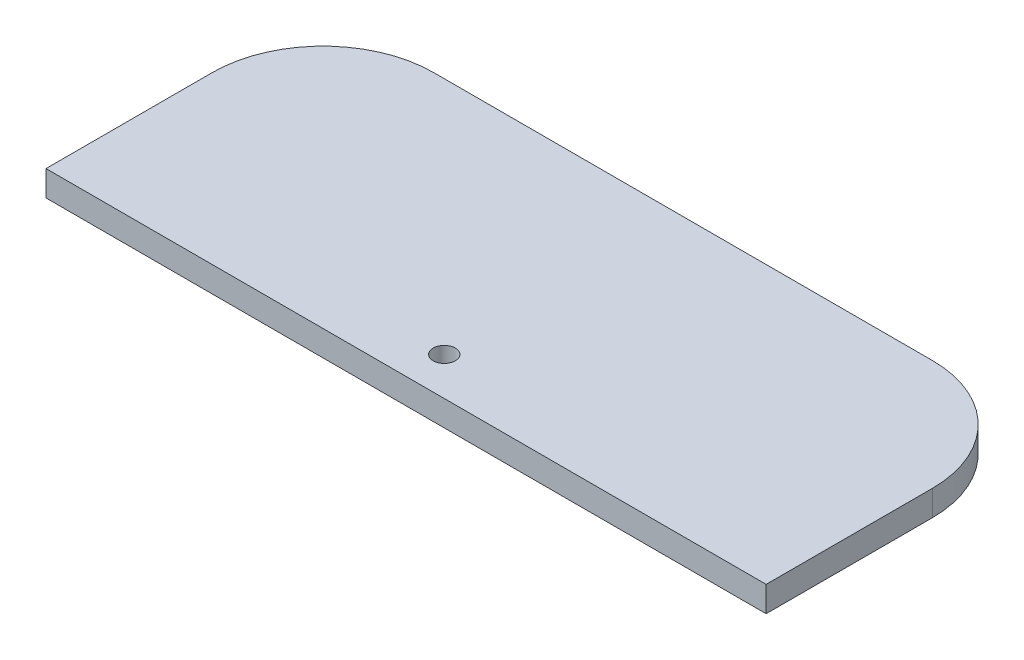
ISO-10303-21;
HEADER;
FILE_DESCRIPTION(('STEP AP214'),'2;1');
FILE_NAME('part.step','',(''),(''),'','','');
FILE_SCHEMA(('AUTOMOTIVE_DESIGN { 1 0 10303 214 1 1 1 1 }'));
ENDSEC;
DATA;
#1=APPLICATION_CONTEXT('core data for automotive mechanical design processes');
#2=APPLICATION_PROTOCOL_DEFINITION('international standard','automotive_design',2000,#1);
#3=PRODUCT_CONTEXT('',#1,'mechanical');
#4=PRODUCT('Part','Part','',(#3));
#5=PRODUCT_RELATED_PRODUCT_CATEGORY('part','',(#4));
#6=PRODUCT_DEFINITION_FORMATION('','',#4);
#7=PRODUCT_DEFINITION_CONTEXT('part definition',#1,'design');
#8=PRODUCT_DEFINITION('design','',#6,#7);
#9=PRODUCT_DEFINITION_SHAPE('','',#8);
#10=(LENGTH_UNIT() NAMED_UNIT(*) SI_UNIT(.MILLI.,.METRE.));
#11=(NAMED_UNIT(*) PLANE_ANGLE_UNIT() SI_UNIT($,.RADIAN.));
#12=(NAMED_UNIT(*) SI_UNIT($,.STERADIAN.) SOLID_ANGLE_UNIT());
#13=UNCERTAINTY_MEASURE_WITH_UNIT(LENGTH_MEASURE(1.E-05),#10,'distance_accuracy_value','');
#14=(GEOMETRIC_REPRESENTATION_CONTEXT(3) GLOBAL_UNCERTAINTY_ASSIGNED_CONTEXT((#13)) GLOBAL_UNIT_ASSIGNED_CONTEXT((#10,
#11,#12)) REPRESENTATION_CONTEXT('',''));
#15=CARTESIAN_POINT('',(0.,0.,0.));
#16=DIRECTION('',(0.,0.,1.));
#17=DIRECTION('',(1.,0.,0.));
#18=AXIS2_PLACEMENT_3D('',#15,#16,#17);
#19=CARTESIAN_POINT('',(0.,2.3,0.));
#20=DIRECTION('',(0.,1.,0.));
#21=DIRECTION('',(0.,0.,1.));
#22=AXIS2_PLACEMENT_3D('',#19,#20,#21);
#23=PLANE('',#22);
#24=DIRECTION('',(0.,0.,-1.));
#25=VECTOR('',#24,1.);
#26=CARTESIAN_POINT('',(32.5,2.3,-12.5));
#27=LINE('',#26,#25);
#28=CARTESIAN_POINT('',(32.5,2.3,12.5));
#29=VERTEX_POINT('',#28);
#30=CARTESIAN_POINT('',(32.5,2.3,-2.5));
#31=VERTEX_POINT('',#30);
#32=EDGE_CURVE('E126',#29,#31,#27,.T.);
#33=ORIENTED_EDGE('',*,*,#32,.T.);
#34=CARTESIAN_POINT('',(22.5,2.3,-2.5));
#35=DIRECTION('',(0.,1.,0.));
#36=DIRECTION('',(0.,0.,1.));
#37=AXIS2_PLACEMENT_3D('',#34,#35,#36);
#38=CIRCLE('',#37,10.);
#39=CARTESIAN_POINT('',(22.5,2.3,-12.5));
#40=VERTEX_POINT('',#39);
#41=EDGE_CURVE('E47',#31,#40,#38,.T.);
#42=ORIENTED_EDGE('',*,*,#41,.T.);
#43=DIRECTION('',(-1.,0.,0.));
#44=VECTOR('',#43,1.);
#45=CARTESIAN_POINT('',(-32.5,2.3,-12.5));
#46=LINE('',#45,#44);
#47=CARTESIAN_POINT('',(-22.5,2.3,-12.5));
#48=VERTEX_POINT('',#47);
#49=EDGE_CURVE('E100',#40,#48,#46,.T.);
#50=ORIENTED_EDGE('',*,*,#49,.T.);
#51=CARTESIAN_POINT('',(-22.5,2.3,-2.5));
#52=DIRECTION('',(0.,1.,0.));
#53=DIRECTION('',(0.,0.,1.));
#54=AXIS2_PLACEMENT_3D('',#51,#52,#53);
#55=CIRCLE('',#54,10.);
#56=CARTESIAN_POINT('',(-32.5,2.3,-2.5));
#57=VERTEX_POINT('',#56);
#58=EDGE_CURVE('E54',#48,#57,#55,.T.);
#59=ORIENTED_EDGE('',*,*,#58,.T.);
#60=DIRECTION('',(0.,0.,1.));
#61=VECTOR('',#60,1.);
#62=CARTESIAN_POINT('',(-32.5,2.3,-12.5));
#63=LINE('',#62,#61);
#64=CARTESIAN_POINT('',(-32.5,2.3,12.5));
#65=VERTEX_POINT('',#64);
#66=EDGE_CURVE('E92',#57,#65,#63,.T.);
#67=ORIENTED_EDGE('',*,*,#66,.T.);
#68=DIRECTION('',(1.,0.,0.));
#69=VECTOR('',#68,1.);
#70=CARTESIAN_POINT('',(-32.5,2.3,12.5));
#71=LINE('',#70,#69);
#72=EDGE_CURVE('E96',#65,#29,#71,.T.);
#73=ORIENTED_EDGE('',*,*,#72,.T.);
#74=EDGE_LOOP('',(#33,#42,#50,#59,#67,#73));
#75=FACE_BOUND('',#74,.T.);
#76=CARTESIAN_POINT('',(0.,2.3,9.05448749329333));
#77=DIRECTION('',(0.,1.,0.));
#78=DIRECTION('',(0.,0.,1.));
#79=AXIS2_PLACEMENT_3D('',#76,#77,#78);
#80=CIRCLE('',#79,1.);
#81=CARTESIAN_POINT('',(0.,2.3,10.0544874932933));
#82=VERTEX_POINT('',#81);
#83=EDGE_CURVE('E121',#82,#82,#80,.T.);
#84=ORIENTED_EDGE('',*,*,#83,.F.);
#85=EDGE_LOOP('',(#84));
#86=FACE_BOUND('',#85,.T.);
#87=ADVANCED_FACE('F39',(#75,#86),#23,.T.);
#88=CARTESIAN_POINT('',(0.,0.,0.));
#89=DIRECTION('',(0.,1.,0.));
#90=DIRECTION('',(0.,0.,1.));
#91=AXIS2_PLACEMENT_3D('',#88,#89,#90);
#92=PLANE('',#91);
#93=DIRECTION('',(-1.,0.,0.));
#94=VECTOR('',#93,1.);
#95=CARTESIAN_POINT('',(-32.5,0.,-12.5));
#96=LINE('',#95,#94);
#97=CARTESIAN_POINT('',(22.5,0.,-12.5));
#98=VERTEX_POINT('',#97);
#99=CARTESIAN_POINT('',(-22.5,0.,-12.5));
#100=VERTEX_POINT('',#99);
#101=EDGE_CURVE('E120',#98,#100,#96,.T.);
#102=ORIENTED_EDGE('',*,*,#101,.F.);
#103=CARTESIAN_POINT('',(22.5,0.,-2.5));
#104=DIRECTION('',(0.,1.,0.));
#105=DIRECTION('',(0.,0.,1.));
#106=AXIS2_PLACEMENT_3D('',#103,#104,#105);
#107=CIRCLE('',#106,10.);
#108=CARTESIAN_POINT('',(32.5,0.,-2.5));
#109=VERTEX_POINT('',#108);
#110=EDGE_CURVE('E134',#98,#109,#107,.F.);
#111=ORIENTED_EDGE('',*,*,#110,.T.);
#112=DIRECTION('',(0.,0.,-1.));
#113=VECTOR('',#112,1.);
#114=CARTESIAN_POINT('',(32.5,0.,-12.5));
#115=LINE('',#114,#113);
#116=CARTESIAN_POINT('',(32.5,0.,12.5));
#117=VERTEX_POINT('',#116);
#118=EDGE_CURVE('E118',#117,#109,#115,.T.);
#119=ORIENTED_EDGE('',*,*,#118,.F.);
#120=DIRECTION('',(1.,0.,0.));
#121=VECTOR('',#120,1.);
#122=CARTESIAN_POINT('',(-32.5,0.,12.5));
#123=LINE('',#122,#121);
#124=CARTESIAN_POINT('',(-32.5,0.,12.5));
#125=VERTEX_POINT('',#124);
#126=EDGE_CURVE('E125',#125,#117,#123,.T.);
#127=ORIENTED_EDGE('',*,*,#126,.F.);
#128=DIRECTION('',(0.,0.,1.));
#129=VECTOR('',#128,1.);
#130=CARTESIAN_POINT('',(-32.5,0.,-12.5));
#131=LINE('',#130,#129);
#132=CARTESIAN_POINT('',(-32.5,0.,-2.5));
#133=VERTEX_POINT('',#132);
#134=EDGE_CURVE('E106',#133,#125,#131,.T.);
#135=ORIENTED_EDGE('',*,*,#134,.F.);
#136=CARTESIAN_POINT('',(-22.5,0.,-2.5));
#137=DIRECTION('',(0.,1.,0.));
#138=DIRECTION('',(0.,0.,1.));
#139=AXIS2_PLACEMENT_3D('',#136,#137,#138);
#140=CIRCLE('',#139,10.);
#141=EDGE_CURVE('E132',#133,#100,#140,.F.);
#142=ORIENTED_EDGE('',*,*,#141,.T.);
#143=EDGE_LOOP('',(#102,#111,#119,#127,#135,#142));
#144=FACE_BOUND('',#143,.T.);
#145=CARTESIAN_POINT('',(0.,0.,9.05448749329333));
#146=DIRECTION('',(0.,1.,0.));
#147=DIRECTION('',(0.,0.,1.));
#148=AXIS2_PLACEMENT_3D('',#145,#146,#147);
#149=CIRCLE('',#148,1.);
#150=CARTESIAN_POINT('',(0.,0.,10.0544874932933));
#151=VERTEX_POINT('',#150);
#152=EDGE_CURVE('E153',#151,#151,#149,.T.);
#153=ORIENTED_EDGE('',*,*,#152,.T.);
#154=EDGE_LOOP('',(#153));
#155=FACE_BOUND('',#154,.T.);
#156=ADVANCED_FACE('F148',(#144,#155),#92,.F.);
#157=CARTESIAN_POINT('',(32.5,2.3,-12.5));
#158=DIRECTION('',(-1.,0.,0.));
#159=DIRECTION('',(0.,0.,1.));
#160=AXIS2_PLACEMENT_3D('',#157,#158,#159);
#161=PLANE('',#160);
#162=ORIENTED_EDGE('',*,*,#118,.T.);
#163=DIRECTION('',(0.,-1.,0.));
#164=VECTOR('',#163,1.);
#165=CARTESIAN_POINT('',(32.5,2.3,-2.5));
#166=LINE('',#165,#164);
#167=EDGE_CURVE('E62',#109,#31,#166,.F.);
#168=ORIENTED_EDGE('',*,*,#167,.T.);
#169=ORIENTED_EDGE('',*,*,#32,.F.);
#170=DIRECTION('',(0.,-1.,0.));
#171=VECTOR('',#170,1.);
#172=CARTESIAN_POINT('',(32.5,2.3,12.5));
#173=LINE('',#172,#171);
#174=EDGE_CURVE('E110',#29,#117,#173,.T.);
#175=ORIENTED_EDGE('',*,*,#174,.T.);
#176=EDGE_LOOP('',(#162,#168,#169,#175));
#177=FACE_BOUND('',#176,.T.);
#178=ADVANCED_FACE('F150',(#177),#161,.F.);
#179=CARTESIAN_POINT('',(-32.5,2.3,-12.5));
#180=DIRECTION('',(0.,0.,1.));
#181=DIRECTION('',(1.,0.,0.));
#182=AXIS2_PLACEMENT_3D('',#179,#180,#181);
#183=PLANE('',#182);
#184=ORIENTED_EDGE('',*,*,#49,.F.);
#185=DIRECTION('',(0.,-1.,0.));
#186=VECTOR('',#185,1.);
#187=CARTESIAN_POINT('',(22.5,2.3,-12.5));
#188=LINE('',#187,#186);
#189=EDGE_CURVE('E129',#40,#98,#188,.T.);
#190=ORIENTED_EDGE('',*,*,#189,.T.);
#191=ORIENTED_EDGE('',*,*,#101,.T.);
#192=DIRECTION('',(0.,-1.,0.));
#193=VECTOR('',#192,1.);
#194=CARTESIAN_POINT('',(-22.5,2.3,-12.5));
#195=LINE('',#194,#193);
#196=EDGE_CURVE('E109',#100,#48,#195,.F.);
#197=ORIENTED_EDGE('',*,*,#196,.T.);
#198=EDGE_LOOP('',(#184,#190,#191,#197));
#199=FACE_BOUND('',#198,.T.);
#200=ADVANCED_FACE('F142',(#199),#183,.F.);
#201=CARTESIAN_POINT('',(-32.5,2.3,-12.5));
#202=DIRECTION('',(1.,0.,0.));
#203=DIRECTION('',(0.,0.,-1.));
#204=AXIS2_PLACEMENT_3D('',#201,#202,#203);
#205=PLANE('',#204);
#206=ORIENTED_EDGE('',*,*,#66,.F.);
#207=DIRECTION('',(0.,-1.,0.));
#208=VECTOR('',#207,1.);
#209=CARTESIAN_POINT('',(-32.5,2.3,-2.5));
#210=LINE('',#209,#208);
#211=EDGE_CURVE('E11',#57,#133,#210,.T.);
#212=ORIENTED_EDGE('',*,*,#211,.T.);
#213=ORIENTED_EDGE('',*,*,#134,.T.);
#214=DIRECTION('',(0.,-1.,0.));
#215=VECTOR('',#214,1.);
#216=CARTESIAN_POINT('',(-32.5,2.3,12.5));
#217=LINE('',#216,#215);
#218=EDGE_CURVE('E103',#65,#125,#217,.T.);
#219=ORIENTED_EDGE('',*,*,#218,.F.);
#220=EDGE_LOOP('',(#206,#212,#213,#219));
#221=FACE_BOUND('',#220,.T.);
#222=ADVANCED_FACE('F104',(#221),#205,.F.);
#223=CARTESIAN_POINT('',(-32.5,2.3,12.5));
#224=DIRECTION('',(0.,0.,-1.));
#225=DIRECTION('',(-1.,0.,0.));
#226=AXIS2_PLACEMENT_3D('',#223,#224,#225);
#227=PLANE('',#226);
#228=ORIENTED_EDGE('',*,*,#126,.T.);
#229=ORIENTED_EDGE('',*,*,#174,.F.);
#230=ORIENTED_EDGE('',*,*,#72,.F.);
#231=ORIENTED_EDGE('',*,*,#218,.T.);
#232=EDGE_LOOP('',(#228,#229,#230,#231));
#233=FACE_BOUND('',#232,.T.);
#234=ADVANCED_FACE('F112',(#233),#227,.F.);
#235=CARTESIAN_POINT('',(0.,2.3,9.05448749329333));
#236=DIRECTION('',(0.,-1.,0.));
#237=DIRECTION('',(0.,0.,-1.));
#238=AXIS2_PLACEMENT_3D('',#235,#236,#237);
#239=CYLINDRICAL_SURFACE('',#238,1.);
#240=ORIENTED_EDGE('',*,*,#83,.T.);
#241=EDGE_LOOP('',(#240));
#242=FACE_BOUND('',#241,.T.);
#243=ORIENTED_EDGE('',*,*,#152,.F.);
#244=EDGE_LOOP('',(#243));
#245=FACE_BOUND('',#244,.T.);
#246=ADVANCED_FACE('F159',(#242,#245),#239,.F.);
#247=CARTESIAN_POINT('',(22.5,2.3,-2.5));
#248=DIRECTION('',(0.,-1.,0.));
#249=DIRECTION('',(0.,0.,-1.));
#250=AXIS2_PLACEMENT_3D('',#247,#248,#249);
#251=CYLINDRICAL_SURFACE('',#250,10.);
#252=ORIENTED_EDGE('',*,*,#41,.F.);
#253=ORIENTED_EDGE('',*,*,#167,.F.);
#254=ORIENTED_EDGE('',*,*,#110,.F.);
#255=ORIENTED_EDGE('',*,*,#189,.F.);
#256=EDGE_LOOP('',(#252,#253,#254,#255));
#257=FACE_BOUND('',#256,.T.);
#258=ADVANCED_FACE('F145',(#257),#251,.T.);
#259=CARTESIAN_POINT('',(-22.5,2.3,-2.5));
#260=DIRECTION('',(0.,-1.,0.));
#261=DIRECTION('',(0.,0.,-1.));
#262=AXIS2_PLACEMENT_3D('',#259,#260,#261);
#263=CYLINDRICAL_SURFACE('',#262,10.);
#264=ORIENTED_EDGE('',*,*,#58,.F.);
#265=ORIENTED_EDGE('',*,*,#196,.F.);
#266=ORIENTED_EDGE('',*,*,#141,.F.);
#267=ORIENTED_EDGE('',*,*,#211,.F.);
#268=EDGE_LOOP('',(#264,#265,#266,#267));
#269=FACE_BOUND('',#268,.T.);
#270=ADVANCED_FACE('F41',(#269),#263,.T.);
#271=CLOSED_SHELL('',(#87,#156,#178,#200,#222,#234,#246,#258,#270));
#272=MANIFOLD_SOLID_BREP('B2',#271);
#273=ADVANCED_BREP_SHAPE_REPRESENTATION('',(#18,#272),#14);
#274=SHAPE_DEFINITION_REPRESENTATION(#9,#273);
ENDSEC;
END-ISO-10303-21;
